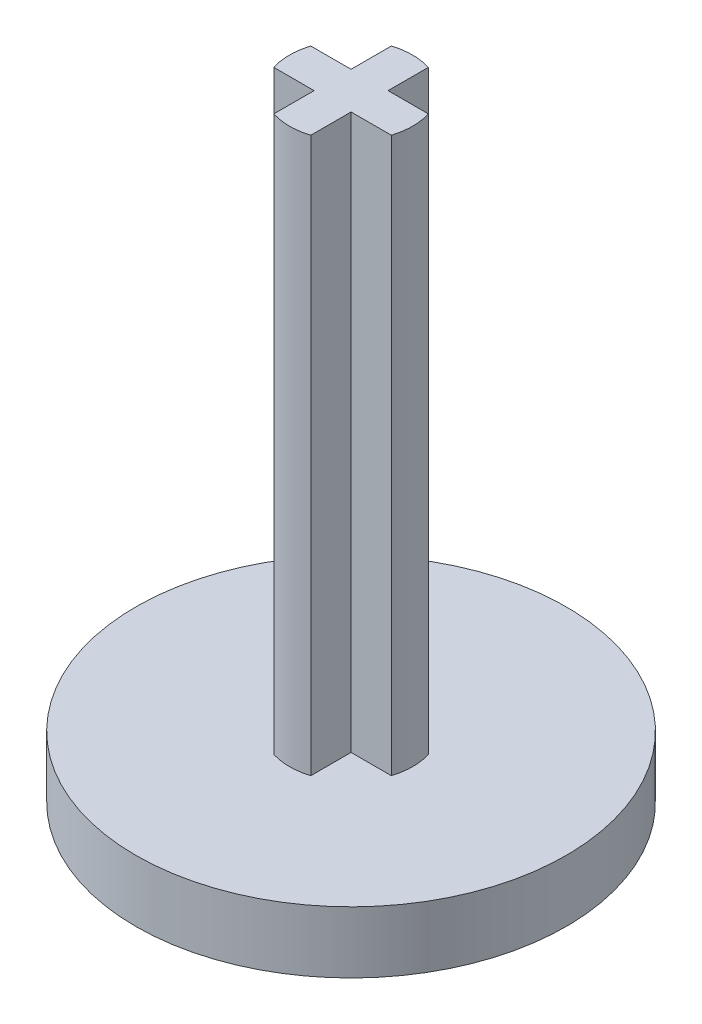
ISO-10303-21;
HEADER;
FILE_DESCRIPTION(('STEP AP214'),'2;1');
FILE_NAME('part.step','',(''),(''),'','','');
FILE_SCHEMA(('AUTOMOTIVE_DESIGN { 1 0 10303 214 1 1 1 1 }'));
ENDSEC;
DATA;
#1=APPLICATION_CONTEXT('core data for automotive mechanical design processes');
#2=APPLICATION_PROTOCOL_DEFINITION('international standard','automotive_design',2000,#1);
#3=PRODUCT_CONTEXT('',#1,'mechanical');
#4=PRODUCT('Part','Part','',(#3));
#5=PRODUCT_RELATED_PRODUCT_CATEGORY('part','',(#4));
#6=PRODUCT_DEFINITION_FORMATION('','',#4);
#7=PRODUCT_DEFINITION_CONTEXT('part definition',#1,'design');
#8=PRODUCT_DEFINITION('design','',#6,#7);
#9=PRODUCT_DEFINITION_SHAPE('','',#8);
#10=(LENGTH_UNIT() NAMED_UNIT(*) SI_UNIT(.MILLI.,.METRE.));
#11=(NAMED_UNIT(*) PLANE_ANGLE_UNIT() SI_UNIT($,.RADIAN.));
#12=(NAMED_UNIT(*) SI_UNIT($,.STERADIAN.) SOLID_ANGLE_UNIT());
#13=UNCERTAINTY_MEASURE_WITH_UNIT(LENGTH_MEASURE(1.E-05),#10,'distance_accuracy_value','');
#14=(GEOMETRIC_REPRESENTATION_CONTEXT(3) GLOBAL_UNCERTAINTY_ASSIGNED_CONTEXT((#13)) GLOBAL_UNIT_ASSIGNED_CONTEXT((#10,
#11,#12)) REPRESENTATION_CONTEXT('',''));
#15=CARTESIAN_POINT('',(0.,0.,0.));
#16=DIRECTION('',(0.,0.,1.));
#17=DIRECTION('',(1.,0.,0.));
#18=AXIS2_PLACEMENT_3D('',#15,#16,#17);
#19=CARTESIAN_POINT('',(0.,5.,0.));
#20=DIRECTION('',(0.,-1.,0.));
#21=DIRECTION('',(0.,0.,-1.));
#22=AXIS2_PLACEMENT_3D('',#19,#20,#21);
#23=CYLINDRICAL_SURFACE('',#22,17.4625);
#24=CARTESIAN_POINT('',(0.,5.,0.));
#25=DIRECTION('',(0.,1.,0.));
#26=DIRECTION('',(0.,0.,1.));
#27=AXIS2_PLACEMENT_3D('',#24,#25,#26);
#28=CIRCLE('',#27,17.4625);
#29=CARTESIAN_POINT('',(0.,5.,17.4625));
#30=VERTEX_POINT('',#29);
#31=EDGE_CURVE('E48',#30,#30,#28,.T.);
#32=ORIENTED_EDGE('',*,*,#31,.F.);
#33=EDGE_LOOP('',(#32));
#34=FACE_BOUND('',#33,.T.);
#35=CARTESIAN_POINT('',(0.,0.,0.));
#36=DIRECTION('',(0.,1.,0.));
#37=DIRECTION('',(0.,0.,1.));
#38=AXIS2_PLACEMENT_3D('',#35,#36,#37);
#39=CIRCLE('',#38,17.4625);
#40=CARTESIAN_POINT('',(0.,0.,17.4625));
#41=VERTEX_POINT('',#40);
#42=EDGE_CURVE('E149',#41,#41,#39,.T.);
#43=ORIENTED_EDGE('',*,*,#42,.T.);
#44=EDGE_LOOP('',(#43));
#45=FACE_BOUND('',#44,.T.);
#46=ADVANCED_FACE('F41',(#34,#45),#23,.T.);
#47=CARTESIAN_POINT('',(0.,5.,0.));
#48=DIRECTION('',(0.,1.,0.));
#49=DIRECTION('',(0.,0.,1.));
#50=AXIS2_PLACEMENT_3D('',#47,#48,#49);
#51=PLANE('',#50);
#52=CARTESIAN_POINT('',(0.,5.,0.));
#53=DIRECTION('',(0.,1.,0.));
#54=DIRECTION('',(0.,0.,1.));
#55=AXIS2_PLACEMENT_3D('',#52,#53,#54);
#56=CIRCLE('',#55,5.);
#57=CARTESIAN_POINT('',(-4.76969600708473,5.,-1.5));
#58=VERTEX_POINT('',#57);
#59=CARTESIAN_POINT('',(-4.76969600708473,5.,1.5));
#60=VERTEX_POINT('',#59);
#61=EDGE_CURVE('E141',#58,#60,#56,.T.);
#62=ORIENTED_EDGE('',*,*,#61,.F.);
#63=DIRECTION('',(-1.,0.,0.));
#64=VECTOR('',#63,1.);
#65=CARTESIAN_POINT('',(-4.76969600708473,5.,-1.5));
#66=LINE('',#65,#64);
#67=CARTESIAN_POINT('',(-1.5,5.,-1.5));
#68=VERTEX_POINT('',#67);
#69=EDGE_CURVE('E140',#68,#58,#66,.T.);
#70=ORIENTED_EDGE('',*,*,#69,.F.);
#71=DIRECTION('',(0.,0.,1.));
#72=VECTOR('',#71,1.);
#73=CARTESIAN_POINT('',(-1.5,5.,-4.76969600708473));
#74=LINE('',#73,#72);
#75=CARTESIAN_POINT('',(-1.5,5.,-4.76969600708473));
#76=VERTEX_POINT('',#75);
#77=EDGE_CURVE('E154',#76,#68,#74,.T.);
#78=ORIENTED_EDGE('',*,*,#77,.F.);
#79=CARTESIAN_POINT('',(0.,5.,0.));
#80=DIRECTION('',(0.,1.,0.));
#81=DIRECTION('',(0.,0.,1.));
#82=AXIS2_PLACEMENT_3D('',#79,#80,#81);
#83=CIRCLE('',#82,5.);
#84=CARTESIAN_POINT('',(1.5,5.,-4.76969600708473));
#85=VERTEX_POINT('',#84);
#86=EDGE_CURVE('E160',#85,#76,#83,.T.);
#87=ORIENTED_EDGE('',*,*,#86,.F.);
#88=DIRECTION('',(0.,0.,-1.));
#89=VECTOR('',#88,1.);
#90=CARTESIAN_POINT('',(1.5,5.,-4.76969600708473));
#91=LINE('',#90,#89);
#92=CARTESIAN_POINT('',(1.5,5.,-1.5));
#93=VERTEX_POINT('',#92);
#94=EDGE_CURVE('E164',#93,#85,#91,.T.);
#95=ORIENTED_EDGE('',*,*,#94,.F.);
#96=DIRECTION('',(-1.,0.,0.));
#97=VECTOR('',#96,1.);
#98=CARTESIAN_POINT('',(1.5,5.,-1.5));
#99=LINE('',#98,#97);
#100=CARTESIAN_POINT('',(4.76969600708473,5.,-1.5));
#101=VERTEX_POINT('',#100);
#102=EDGE_CURVE('E168',#101,#93,#99,.T.);
#103=ORIENTED_EDGE('',*,*,#102,.F.);
#104=CARTESIAN_POINT('',(0.,5.,0.));
#105=DIRECTION('',(0.,1.,0.));
#106=DIRECTION('',(0.,0.,1.));
#107=AXIS2_PLACEMENT_3D('',#104,#105,#106);
#108=CIRCLE('',#107,5.);
#109=CARTESIAN_POINT('',(4.76969600708473,5.,1.5));
#110=VERTEX_POINT('',#109);
#111=EDGE_CURVE('E172',#110,#101,#108,.T.);
#112=ORIENTED_EDGE('',*,*,#111,.F.);
#113=DIRECTION('',(1.,0.,0.));
#114=VECTOR('',#113,1.);
#115=CARTESIAN_POINT('',(1.5,5.,1.5));
#116=LINE('',#115,#114);
#117=CARTESIAN_POINT('',(1.5,5.,1.5));
#118=VERTEX_POINT('',#117);
#119=EDGE_CURVE('E176',#118,#110,#116,.T.);
#120=ORIENTED_EDGE('',*,*,#119,.F.);
#121=DIRECTION('',(0.,0.,-1.));
#122=VECTOR('',#121,1.);
#123=CARTESIAN_POINT('',(1.5,5.,1.5));
#124=LINE('',#123,#122);
#125=CARTESIAN_POINT('',(1.5,5.,4.76969600708473));
#126=VERTEX_POINT('',#125);
#127=EDGE_CURVE('E180',#126,#118,#124,.T.);
#128=ORIENTED_EDGE('',*,*,#127,.F.);
#129=CARTESIAN_POINT('',(0.,5.,0.));
#130=DIRECTION('',(0.,1.,0.));
#131=DIRECTION('',(0.,0.,1.));
#132=AXIS2_PLACEMENT_3D('',#129,#130,#131);
#133=CIRCLE('',#132,5.);
#134=CARTESIAN_POINT('',(-1.5,5.,4.76969600708473));
#135=VERTEX_POINT('',#134);
#136=EDGE_CURVE('E184',#135,#126,#133,.T.);
#137=ORIENTED_EDGE('',*,*,#136,.F.);
#138=DIRECTION('',(0.,0.,1.));
#139=VECTOR('',#138,1.);
#140=CARTESIAN_POINT('',(-1.5,5.,1.5));
#141=LINE('',#140,#139);
#142=CARTESIAN_POINT('',(-1.5,5.,1.5));
#143=VERTEX_POINT('',#142);
#144=EDGE_CURVE('E188',#143,#135,#141,.T.);
#145=ORIENTED_EDGE('',*,*,#144,.F.);
#146=DIRECTION('',(1.,0.,0.));
#147=VECTOR('',#146,1.);
#148=CARTESIAN_POINT('',(-4.76969600708473,5.,1.5));
#149=LINE('',#148,#147);
#150=EDGE_CURVE('E192',#60,#143,#149,.T.);
#151=ORIENTED_EDGE('',*,*,#150,.F.);
#152=EDGE_LOOP('',(#62,#70,#78,#87,#95,#103,#112,#120,#128,#137,#145,#151));
#153=FACE_BOUND('',#152,.T.);
#154=ORIENTED_EDGE('',*,*,#31,.T.);
#155=EDGE_LOOP('',(#154));
#156=FACE_BOUND('',#155,.T.);
#157=ADVANCED_FACE('F211',(#153,#156),#51,.T.);
#158=CARTESIAN_POINT('',(0.,0.,0.));
#159=DIRECTION('',(0.,1.,0.));
#160=DIRECTION('',(0.,0.,1.));
#161=AXIS2_PLACEMENT_3D('',#158,#159,#160);
#162=PLANE('',#161);
#163=ORIENTED_EDGE('',*,*,#42,.F.);
#164=EDGE_LOOP('',(#163));
#165=FACE_BOUND('',#164,.T.);
#166=ADVANCED_FACE('F277',(#165),#162,.F.);
#167=CARTESIAN_POINT('',(0.,141.142135623731,0.));
#168=DIRECTION('',(0.,-1.,0.));
#169=DIRECTION('',(0.,0.,-1.));
#170=AXIS2_PLACEMENT_3D('',#167,#168,#169);
#171=CYLINDRICAL_SURFACE('',#170,5.);
#172=DIRECTION('',(0.,-1.,0.));
#173=VECTOR('',#172,1.);
#174=CARTESIAN_POINT('',(-4.76969600708473,141.142135623731,1.5));
#175=LINE('',#174,#173);
#176=CARTESIAN_POINT('',(-4.76969600708473,50.,1.5));
#177=VERTEX_POINT('',#176);
#178=EDGE_CURVE('E134',#177,#60,#175,.T.);
#179=ORIENTED_EDGE('',*,*,#178,.F.);
#180=CARTESIAN_POINT('',(0.,50.,0.));
#181=DIRECTION('',(0.,-1.,0.));
#182=DIRECTION('',(0.,0.,-1.));
#183=AXIS2_PLACEMENT_3D('',#180,#181,#182);
#184=CIRCLE('',#183,5.);
#185=CARTESIAN_POINT('',(-4.76969600708473,50.,-1.5));
#186=VERTEX_POINT('',#185);
#187=EDGE_CURVE('E128',#177,#186,#184,.T.);
#188=ORIENTED_EDGE('',*,*,#187,.T.);
#189=DIRECTION('',(0.,-1.,0.));
#190=VECTOR('',#189,1.);
#191=CARTESIAN_POINT('',(-4.76969600708473,141.142135623731,-1.5));
#192=LINE('',#191,#190);
#193=EDGE_CURVE('E62',#186,#58,#192,.T.);
#194=ORIENTED_EDGE('',*,*,#193,.T.);
#195=ORIENTED_EDGE('',*,*,#61,.T.);
#196=EDGE_LOOP('',(#179,#188,#194,#195));
#197=FACE_BOUND('',#196,.T.);
#198=ADVANCED_FACE('F133',(#197),#171,.T.);
#199=CARTESIAN_POINT('',(-4.76969600708473,141.142135623731,1.5));
#200=DIRECTION('',(0.,0.,-1.));
#201=DIRECTION('',(-1.,0.,0.));
#202=AXIS2_PLACEMENT_3D('',#199,#200,#201);
#203=PLANE('',#202);
#204=DIRECTION('',(0.,-1.,0.));
#205=VECTOR('',#204,1.);
#206=CARTESIAN_POINT('',(-1.5,141.142135623731,1.5));
#207=LINE('',#206,#205);
#208=CARTESIAN_POINT('',(-1.5,50.,1.5));
#209=VERTEX_POINT('',#208);
#210=EDGE_CURVE('E191',#209,#143,#207,.T.);
#211=ORIENTED_EDGE('',*,*,#210,.F.);
#212=DIRECTION('',(-1.,0.,0.));
#213=VECTOR('',#212,1.);
#214=CARTESIAN_POINT('',(-4.76969600708473,50.,1.5));
#215=LINE('',#214,#213);
#216=EDGE_CURVE('E135',#209,#177,#215,.T.);
#217=ORIENTED_EDGE('',*,*,#216,.T.);
#218=ORIENTED_EDGE('',*,*,#178,.T.);
#219=ORIENTED_EDGE('',*,*,#150,.T.);
#220=EDGE_LOOP('',(#211,#217,#218,#219));
#221=FACE_BOUND('',#220,.T.);
#222=ADVANCED_FACE('F260',(#221),#203,.F.);
#223=CARTESIAN_POINT('',(-1.5,141.142135623731,1.5));
#224=DIRECTION('',(1.,0.,0.));
#225=DIRECTION('',(0.,0.,-1.));
#226=AXIS2_PLACEMENT_3D('',#223,#224,#225);
#227=PLANE('',#226);
#228=DIRECTION('',(0.,-1.,0.));
#229=VECTOR('',#228,1.);
#230=CARTESIAN_POINT('',(-1.5,141.142135623731,4.76969600708473));
#231=LINE('',#230,#229);
#232=CARTESIAN_POINT('',(-1.5,50.,4.76969600708473));
#233=VERTEX_POINT('',#232);
#234=EDGE_CURVE('E187',#233,#135,#231,.T.);
#235=ORIENTED_EDGE('',*,*,#234,.F.);
#236=DIRECTION('',(0.,0.,-1.));
#237=VECTOR('',#236,1.);
#238=CARTESIAN_POINT('',(-1.5,50.,1.5));
#239=LINE('',#238,#237);
#240=EDGE_CURVE('E256',#233,#209,#239,.T.);
#241=ORIENTED_EDGE('',*,*,#240,.T.);
#242=ORIENTED_EDGE('',*,*,#210,.T.);
#243=ORIENTED_EDGE('',*,*,#144,.T.);
#244=EDGE_LOOP('',(#235,#241,#242,#243));
#245=FACE_BOUND('',#244,.T.);
#246=ADVANCED_FACE('F255',(#245),#227,.F.);
#247=CARTESIAN_POINT('',(0.,141.142135623731,0.));
#248=DIRECTION('',(0.,-1.,0.));
#249=DIRECTION('',(0.,0.,-1.));
#250=AXIS2_PLACEMENT_3D('',#247,#248,#249);
#251=CYLINDRICAL_SURFACE('',#250,5.);
#252=DIRECTION('',(0.,-1.,0.));
#253=VECTOR('',#252,1.);
#254=CARTESIAN_POINT('',(1.5,141.142135623731,4.76969600708473));
#255=LINE('',#254,#253);
#256=CARTESIAN_POINT('',(1.5,50.,4.76969600708473));
#257=VERTEX_POINT('',#256);
#258=EDGE_CURVE('E183',#257,#126,#255,.T.);
#259=ORIENTED_EDGE('',*,*,#258,.F.);
#260=CARTESIAN_POINT('',(0.,50.,0.));
#261=DIRECTION('',(0.,-1.,0.));
#262=DIRECTION('',(0.,0.,-1.));
#263=AXIS2_PLACEMENT_3D('',#260,#261,#262);
#264=CIRCLE('',#263,5.);
#265=EDGE_CURVE('E252',#257,#233,#264,.T.);
#266=ORIENTED_EDGE('',*,*,#265,.T.);
#267=ORIENTED_EDGE('',*,*,#234,.T.);
#268=ORIENTED_EDGE('',*,*,#136,.T.);
#269=EDGE_LOOP('',(#259,#266,#267,#268));
#270=FACE_BOUND('',#269,.T.);
#271=ADVANCED_FACE('F249',(#270),#251,.T.);
#272=CARTESIAN_POINT('',(1.5,141.142135623731,1.5));
#273=DIRECTION('',(-1.,0.,0.));
#274=DIRECTION('',(0.,0.,1.));
#275=AXIS2_PLACEMENT_3D('',#272,#273,#274);
#276=PLANE('',#275);
#277=DIRECTION('',(0.,-1.,0.));
#278=VECTOR('',#277,1.);
#279=CARTESIAN_POINT('',(1.5,141.142135623731,1.5));
#280=LINE('',#279,#278);
#281=CARTESIAN_POINT('',(1.5,50.,1.5));
#282=VERTEX_POINT('',#281);
#283=EDGE_CURVE('E179',#282,#118,#280,.T.);
#284=ORIENTED_EDGE('',*,*,#283,.F.);
#285=DIRECTION('',(0.,0.,1.));
#286=VECTOR('',#285,1.);
#287=CARTESIAN_POINT('',(1.5,50.,1.5));
#288=LINE('',#287,#286);
#289=EDGE_CURVE('E244',#282,#257,#288,.T.);
#290=ORIENTED_EDGE('',*,*,#289,.T.);
#291=ORIENTED_EDGE('',*,*,#258,.T.);
#292=ORIENTED_EDGE('',*,*,#127,.T.);
#293=EDGE_LOOP('',(#284,#290,#291,#292));
#294=FACE_BOUND('',#293,.T.);
#295=ADVANCED_FACE('F243',(#294),#276,.F.);
#296=CARTESIAN_POINT('',(1.5,141.142135623731,1.5));
#297=DIRECTION('',(0.,0.,-1.));
#298=DIRECTION('',(-1.,0.,0.));
#299=AXIS2_PLACEMENT_3D('',#296,#297,#298);
#300=PLANE('',#299);
#301=DIRECTION('',(0.,-1.,0.));
#302=VECTOR('',#301,1.);
#303=CARTESIAN_POINT('',(4.76969600708473,141.142135623731,1.5));
#304=LINE('',#303,#302);
#305=CARTESIAN_POINT('',(4.76969600708473,50.,1.5));
#306=VERTEX_POINT('',#305);
#307=EDGE_CURVE('E175',#306,#110,#304,.T.);
#308=ORIENTED_EDGE('',*,*,#307,.F.);
#309=DIRECTION('',(-1.,0.,0.));
#310=VECTOR('',#309,1.);
#311=CARTESIAN_POINT('',(1.5,50.,1.5));
#312=LINE('',#311,#310);
#313=EDGE_CURVE('E240',#306,#282,#312,.T.);
#314=ORIENTED_EDGE('',*,*,#313,.T.);
#315=ORIENTED_EDGE('',*,*,#283,.T.);
#316=ORIENTED_EDGE('',*,*,#119,.T.);
#317=EDGE_LOOP('',(#308,#314,#315,#316));
#318=FACE_BOUND('',#317,.T.);
#319=ADVANCED_FACE('F237',(#318),#300,.F.);
#320=CARTESIAN_POINT('',(0.,141.142135623731,0.));
#321=DIRECTION('',(0.,-1.,0.));
#322=DIRECTION('',(0.,0.,-1.));
#323=AXIS2_PLACEMENT_3D('',#320,#321,#322);
#324=CYLINDRICAL_SURFACE('',#323,5.);
#325=DIRECTION('',(0.,-1.,0.));
#326=VECTOR('',#325,1.);
#327=CARTESIAN_POINT('',(4.76969600708473,141.142135623731,-1.5));
#328=LINE('',#327,#326);
#329=CARTESIAN_POINT('',(4.76969600708473,50.,-1.5));
#330=VERTEX_POINT('',#329);
#331=EDGE_CURVE('E171',#330,#101,#328,.T.);
#332=ORIENTED_EDGE('',*,*,#331,.F.);
#333=CARTESIAN_POINT('',(0.,50.,0.));
#334=DIRECTION('',(0.,-1.,0.));
#335=DIRECTION('',(0.,0.,-1.));
#336=AXIS2_PLACEMENT_3D('',#333,#334,#335);
#337=CIRCLE('',#336,5.);
#338=EDGE_CURVE('E232',#330,#306,#337,.T.);
#339=ORIENTED_EDGE('',*,*,#338,.T.);
#340=ORIENTED_EDGE('',*,*,#307,.T.);
#341=ORIENTED_EDGE('',*,*,#111,.T.);
#342=EDGE_LOOP('',(#332,#339,#340,#341));
#343=FACE_BOUND('',#342,.T.);
#344=ADVANCED_FACE('F231',(#343),#324,.T.);
#345=CARTESIAN_POINT('',(1.5,141.142135623731,-1.5));
#346=DIRECTION('',(0.,0.,1.));
#347=DIRECTION('',(1.,0.,0.));
#348=AXIS2_PLACEMENT_3D('',#345,#346,#347);
#349=PLANE('',#348);
#350=DIRECTION('',(0.,-1.,0.));
#351=VECTOR('',#350,1.);
#352=CARTESIAN_POINT('',(1.5,141.142135623731,-1.5));
#353=LINE('',#352,#351);
#354=CARTESIAN_POINT('',(1.5,50.,-1.5));
#355=VERTEX_POINT('',#354);
#356=EDGE_CURVE('E167',#355,#93,#353,.T.);
#357=ORIENTED_EDGE('',*,*,#356,.F.);
#358=DIRECTION('',(1.,0.,0.));
#359=VECTOR('',#358,1.);
#360=CARTESIAN_POINT('',(1.5,50.,-1.5));
#361=LINE('',#360,#359);
#362=EDGE_CURVE('E228',#355,#330,#361,.T.);
#363=ORIENTED_EDGE('',*,*,#362,.T.);
#364=ORIENTED_EDGE('',*,*,#331,.T.);
#365=ORIENTED_EDGE('',*,*,#102,.T.);
#366=EDGE_LOOP('',(#357,#363,#364,#365));
#367=FACE_BOUND('',#366,.T.);
#368=ADVANCED_FACE('F225',(#367),#349,.F.);
#369=CARTESIAN_POINT('',(1.5,141.142135623731,-4.76969600708473));
#370=DIRECTION('',(-1.,0.,0.));
#371=DIRECTION('',(0.,0.,1.));
#372=AXIS2_PLACEMENT_3D('',#369,#370,#371);
#373=PLANE('',#372);
#374=DIRECTION('',(0.,-1.,0.));
#375=VECTOR('',#374,1.);
#376=CARTESIAN_POINT('',(1.5,141.142135623731,-4.76969600708473));
#377=LINE('',#376,#375);
#378=CARTESIAN_POINT('',(1.5,50.,-4.76969600708473));
#379=VERTEX_POINT('',#378);
#380=EDGE_CURVE('E163',#379,#85,#377,.T.);
#381=ORIENTED_EDGE('',*,*,#380,.F.);
#382=DIRECTION('',(0.,0.,1.));
#383=VECTOR('',#382,1.);
#384=CARTESIAN_POINT('',(1.5,50.,-4.76969600708473));
#385=LINE('',#384,#383);
#386=EDGE_CURVE('E220',#379,#355,#385,.T.);
#387=ORIENTED_EDGE('',*,*,#386,.T.);
#388=ORIENTED_EDGE('',*,*,#356,.T.);
#389=ORIENTED_EDGE('',*,*,#94,.T.);
#390=EDGE_LOOP('',(#381,#387,#388,#389));
#391=FACE_BOUND('',#390,.T.);
#392=ADVANCED_FACE('F219',(#391),#373,.F.);
#393=CARTESIAN_POINT('',(0.,141.142135623731,0.));
#394=DIRECTION('',(0.,-1.,0.));
#395=DIRECTION('',(0.,0.,-1.));
#396=AXIS2_PLACEMENT_3D('',#393,#394,#395);
#397=CYLINDRICAL_SURFACE('',#396,5.);
#398=DIRECTION('',(0.,-1.,0.));
#399=VECTOR('',#398,1.);
#400=CARTESIAN_POINT('',(-1.5,141.142135623731,-4.76969600708473));
#401=LINE('',#400,#399);
#402=CARTESIAN_POINT('',(-1.5,50.,-4.76969600708473));
#403=VERTEX_POINT('',#402);
#404=EDGE_CURVE('E159',#403,#76,#401,.T.);
#405=ORIENTED_EDGE('',*,*,#404,.F.);
#406=CARTESIAN_POINT('',(0.,50.,0.));
#407=DIRECTION('',(0.,-1.,0.));
#408=DIRECTION('',(0.,0.,-1.));
#409=AXIS2_PLACEMENT_3D('',#406,#407,#408);
#410=CIRCLE('',#409,5.);
#411=EDGE_CURVE('E216',#403,#379,#410,.T.);
#412=ORIENTED_EDGE('',*,*,#411,.T.);
#413=ORIENTED_EDGE('',*,*,#380,.T.);
#414=ORIENTED_EDGE('',*,*,#86,.T.);
#415=EDGE_LOOP('',(#405,#412,#413,#414));
#416=FACE_BOUND('',#415,.T.);
#417=ADVANCED_FACE('F214',(#416),#397,.T.);
#418=CARTESIAN_POINT('',(-1.5,141.142135623731,-4.76969600708473));
#419=DIRECTION('',(1.,0.,0.));
#420=DIRECTION('',(0.,0.,-1.));
#421=AXIS2_PLACEMENT_3D('',#418,#419,#420);
#422=PLANE('',#421);
#423=DIRECTION('',(0.,-1.,0.));
#424=VECTOR('',#423,1.);
#425=CARTESIAN_POINT('',(-1.5,141.142135623731,-1.5));
#426=LINE('',#425,#424);
#427=CARTESIAN_POINT('',(-1.5,50.,-1.5));
#428=VERTEX_POINT('',#427);
#429=EDGE_CURVE('E146',#428,#68,#426,.T.);
#430=ORIENTED_EDGE('',*,*,#429,.F.);
#431=DIRECTION('',(0.,0.,-1.));
#432=VECTOR('',#431,1.);
#433=CARTESIAN_POINT('',(-1.5,50.,-4.76969600708473));
#434=LINE('',#433,#432);
#435=EDGE_CURVE('E55',#428,#403,#434,.T.);
#436=ORIENTED_EDGE('',*,*,#435,.T.);
#437=ORIENTED_EDGE('',*,*,#404,.T.);
#438=ORIENTED_EDGE('',*,*,#77,.T.);
#439=EDGE_LOOP('',(#430,#436,#437,#438));
#440=FACE_BOUND('',#439,.T.);
#441=ADVANCED_FACE('F206',(#440),#422,.F.);
#442=CARTESIAN_POINT('',(-4.76969600708473,141.142135623731,-1.5));
#443=DIRECTION('',(0.,0.,1.));
#444=DIRECTION('',(1.,0.,0.));
#445=AXIS2_PLACEMENT_3D('',#442,#443,#444);
#446=PLANE('',#445);
#447=ORIENTED_EDGE('',*,*,#193,.F.);
#448=DIRECTION('',(1.,0.,0.));
#449=VECTOR('',#448,1.);
#450=CARTESIAN_POINT('',(-4.76969600708473,50.,-1.5));
#451=LINE('',#450,#449);
#452=EDGE_CURVE('E11',#186,#428,#451,.T.);
#453=ORIENTED_EDGE('',*,*,#452,.T.);
#454=ORIENTED_EDGE('',*,*,#429,.T.);
#455=ORIENTED_EDGE('',*,*,#69,.T.);
#456=EDGE_LOOP('',(#447,#453,#454,#455));
#457=FACE_BOUND('',#456,.T.);
#458=ADVANCED_FACE('F138',(#457),#446,.F.);
#459=CARTESIAN_POINT('',(0.,50.,-17.4625));
#460=DIRECTION('',(0.,-1.,0.));
#461=DIRECTION('',(0.,0.,-1.));
#462=AXIS2_PLACEMENT_3D('',#459,#460,#461);
#463=PLANE('',#462);
#464=ORIENTED_EDGE('',*,*,#216,.F.);
#465=ORIENTED_EDGE('',*,*,#240,.F.);
#466=ORIENTED_EDGE('',*,*,#265,.F.);
#467=ORIENTED_EDGE('',*,*,#289,.F.);
#468=ORIENTED_EDGE('',*,*,#313,.F.);
#469=ORIENTED_EDGE('',*,*,#338,.F.);
#470=ORIENTED_EDGE('',*,*,#362,.F.);
#471=ORIENTED_EDGE('',*,*,#386,.F.);
#472=ORIENTED_EDGE('',*,*,#411,.F.);
#473=ORIENTED_EDGE('',*,*,#435,.F.);
#474=ORIENTED_EDGE('',*,*,#452,.F.);
#475=ORIENTED_EDGE('',*,*,#187,.F.);
#476=EDGE_LOOP('',(#464,#465,#466,#467,#468,#469,#470,#471,#472,#473,#474,#475));
#477=FACE_BOUND('',#476,.T.);
#478=ADVANCED_FACE('F127',(#477),#463,.F.);
#479=CLOSED_SHELL('',(#46,#157,#166,#198,#222,#246,#271,#295,#319,#344,#368,#392,#417,#441,#458,#478));
#480=MANIFOLD_SOLID_BREP('B2',#479);
#481=ADVANCED_BREP_SHAPE_REPRESENTATION('',(#18,#480),#14);
#482=SHAPE_DEFINITION_REPRESENTATION(#9,#481);
ENDSEC;
END-ISO-10303-21;
